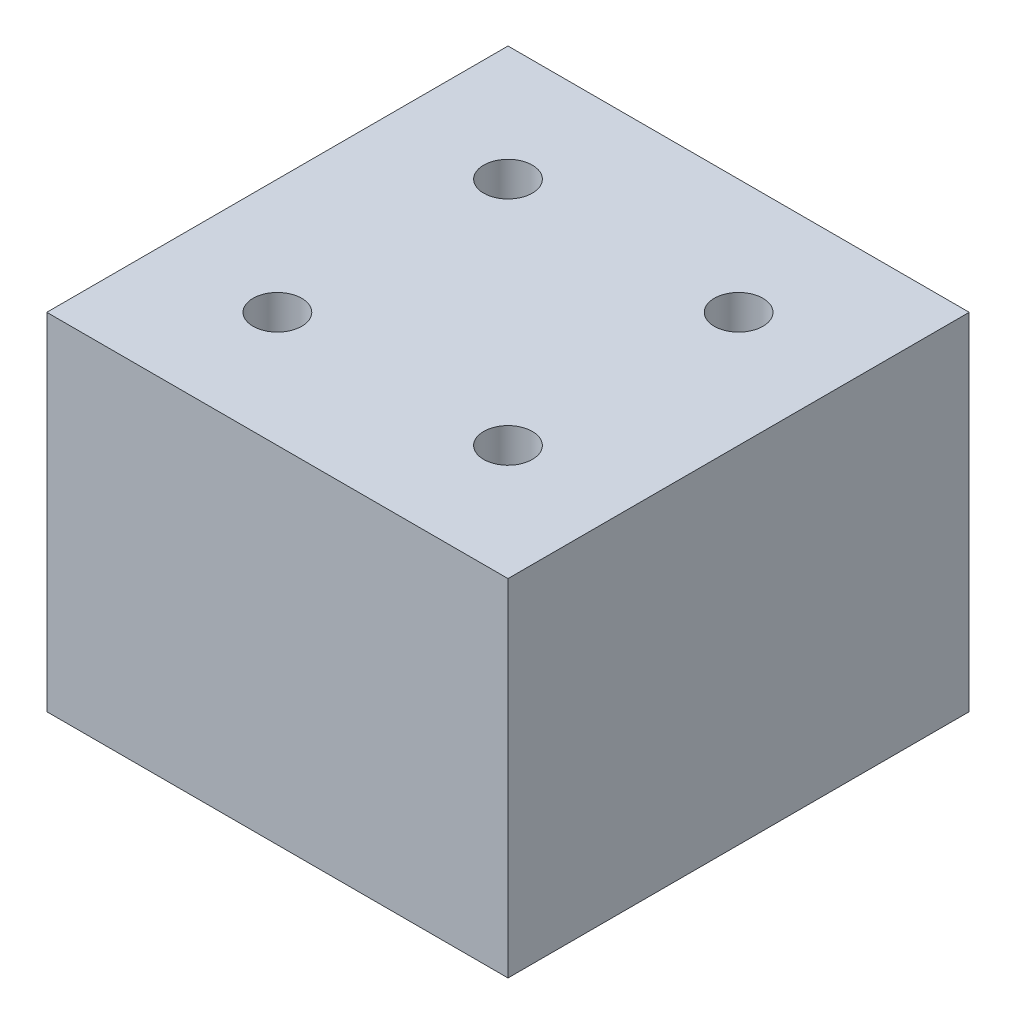
ISO-10303-21;
HEADER;
FILE_DESCRIPTION(('STEP AP214'),'2;1');
FILE_NAME('part.step','',(''),(''),'','','');
FILE_SCHEMA(('AUTOMOTIVE_DESIGN { 1 0 10303 214 1 1 1 1 }'));
ENDSEC;
DATA;
#1=APPLICATION_CONTEXT('core data for automotive mechanical design processes');
#2=APPLICATION_PROTOCOL_DEFINITION('international standard','automotive_design',2000,#1);
#3=PRODUCT_CONTEXT('',#1,'mechanical');
#4=PRODUCT('Part','Part','',(#3));
#5=PRODUCT_RELATED_PRODUCT_CATEGORY('part','',(#4));
#6=PRODUCT_DEFINITION_FORMATION('','',#4);
#7=PRODUCT_DEFINITION_CONTEXT('part definition',#1,'design');
#8=PRODUCT_DEFINITION('design','',#6,#7);
#9=PRODUCT_DEFINITION_SHAPE('','',#8);
#10=(LENGTH_UNIT() NAMED_UNIT(*) SI_UNIT(.MILLI.,.METRE.));
#11=(NAMED_UNIT(*) PLANE_ANGLE_UNIT() SI_UNIT($,.RADIAN.));
#12=(NAMED_UNIT(*) SI_UNIT($,.STERADIAN.) SOLID_ANGLE_UNIT());
#13=UNCERTAINTY_MEASURE_WITH_UNIT(LENGTH_MEASURE(1.E-05),#10,'distance_accuracy_value','');
#14=(GEOMETRIC_REPRESENTATION_CONTEXT(3) GLOBAL_UNCERTAINTY_ASSIGNED_CONTEXT((#13)) GLOBAL_UNIT_ASSIGNED_CONTEXT((#10,
#11,#12)) REPRESENTATION_CONTEXT('',''));
#15=CARTESIAN_POINT('',(0.,0.,0.));
#16=DIRECTION('',(0.,0.,1.));
#17=DIRECTION('',(1.,0.,0.));
#18=AXIS2_PLACEMENT_3D('',#15,#16,#17);
#19=CARTESIAN_POINT('',(0.,76.2,0.));
#20=DIRECTION('',(1.,0.,0.));
#21=DIRECTION('',(0.,0.,-1.));
#22=AXIS2_PLACEMENT_3D('',#19,#20,#21);
#23=PLANE('',#22);
#24=DIRECTION('',(0.,0.,1.));
#25=VECTOR('',#24,1.);
#26=CARTESIAN_POINT('',(0.,0.,0.));
#27=LINE('',#26,#25);
#28=CARTESIAN_POINT('',(0.,0.,-101.6));
#29=VERTEX_POINT('',#28);
#30=CARTESIAN_POINT('',(0.,0.,0.));
#31=VERTEX_POINT('',#30);
#32=EDGE_CURVE('E147',#29,#31,#27,.T.);
#33=ORIENTED_EDGE('',*,*,#32,.T.);
#34=DIRECTION('',(0.,-1.,0.));
#35=VECTOR('',#34,1.);
#36=CARTESIAN_POINT('',(0.,76.2,0.));
#37=LINE('',#36,#35);
#38=CARTESIAN_POINT('',(0.,76.2,0.));
#39=VERTEX_POINT('',#38);
#40=EDGE_CURVE('E11',#39,#31,#37,.T.);
#41=ORIENTED_EDGE('',*,*,#40,.F.);
#42=DIRECTION('',(0.,0.,1.));
#43=VECTOR('',#42,1.);
#44=CARTESIAN_POINT('',(0.,76.2,0.));
#45=LINE('',#44,#43);
#46=CARTESIAN_POINT('',(0.,76.2,-101.6));
#47=VERTEX_POINT('',#46);
#48=EDGE_CURVE('E148',#47,#39,#45,.T.);
#49=ORIENTED_EDGE('',*,*,#48,.F.);
#50=DIRECTION('',(0.,-1.,0.));
#51=VECTOR('',#50,1.);
#52=CARTESIAN_POINT('',(0.,76.2,-101.6));
#53=LINE('',#52,#51);
#54=EDGE_CURVE('E158',#47,#29,#53,.T.);
#55=ORIENTED_EDGE('',*,*,#54,.T.);
#56=EDGE_LOOP('',(#33,#41,#49,#55));
#57=FACE_BOUND('',#56,.T.);
#58=ADVANCED_FACE('F45',(#57),#23,.F.);
#59=CARTESIAN_POINT('',(0.,76.2,0.));
#60=DIRECTION('',(0.,0.,-1.));
#61=DIRECTION('',(-1.,0.,0.));
#62=AXIS2_PLACEMENT_3D('',#59,#60,#61);
#63=PLANE('',#62);
#64=DIRECTION('',(1.,0.,0.));
#65=VECTOR('',#64,1.);
#66=CARTESIAN_POINT('',(0.,0.,0.));
#67=LINE('',#66,#65);
#68=CARTESIAN_POINT('',(101.6,0.,0.));
#69=VERTEX_POINT('',#68);
#70=EDGE_CURVE('E162',#31,#69,#67,.T.);
#71=ORIENTED_EDGE('',*,*,#70,.T.);
#72=DIRECTION('',(0.,-1.,0.));
#73=VECTOR('',#72,1.);
#74=CARTESIAN_POINT('',(101.6,76.2,0.));
#75=LINE('',#74,#73);
#76=CARTESIAN_POINT('',(101.6,76.2,0.));
#77=VERTEX_POINT('',#76);
#78=EDGE_CURVE('E54',#77,#69,#75,.T.);
#79=ORIENTED_EDGE('',*,*,#78,.F.);
#80=DIRECTION('',(1.,0.,0.));
#81=VECTOR('',#80,1.);
#82=CARTESIAN_POINT('',(0.,76.2,0.));
#83=LINE('',#82,#81);
#84=EDGE_CURVE('E93',#39,#77,#83,.T.);
#85=ORIENTED_EDGE('',*,*,#84,.F.);
#86=ORIENTED_EDGE('',*,*,#40,.T.);
#87=EDGE_LOOP('',(#71,#79,#85,#86));
#88=FACE_BOUND('',#87,.T.);
#89=ADVANCED_FACE('F192',(#88),#63,.F.);
#90=CARTESIAN_POINT('',(101.6,76.2,0.));
#91=DIRECTION('',(-1.,0.,0.));
#92=DIRECTION('',(0.,0.,1.));
#93=AXIS2_PLACEMENT_3D('',#90,#91,#92);
#94=PLANE('',#93);
#95=DIRECTION('',(0.,0.,-1.));
#96=VECTOR('',#95,1.);
#97=CARTESIAN_POINT('',(101.6,0.,0.));
#98=LINE('',#97,#96);
#99=CARTESIAN_POINT('',(101.6,0.,-101.6));
#100=VERTEX_POINT('',#99);
#101=EDGE_CURVE('E80',#69,#100,#98,.T.);
#102=ORIENTED_EDGE('',*,*,#101,.T.);
#103=DIRECTION('',(0.,-1.,0.));
#104=VECTOR('',#103,1.);
#105=CARTESIAN_POINT('',(101.6,76.2,-101.6));
#106=LINE('',#105,#104);
#107=CARTESIAN_POINT('',(101.6,76.2,-101.6));
#108=VERTEX_POINT('',#107);
#109=EDGE_CURVE('E171',#108,#100,#106,.T.);
#110=ORIENTED_EDGE('',*,*,#109,.F.);
#111=DIRECTION('',(0.,0.,-1.));
#112=VECTOR('',#111,1.);
#113=CARTESIAN_POINT('',(101.6,76.2,0.));
#114=LINE('',#113,#112);
#115=EDGE_CURVE('E153',#77,#108,#114,.T.);
#116=ORIENTED_EDGE('',*,*,#115,.F.);
#117=ORIENTED_EDGE('',*,*,#78,.T.);
#118=EDGE_LOOP('',(#102,#110,#116,#117));
#119=FACE_BOUND('',#118,.T.);
#120=ADVANCED_FACE('F175',(#119),#94,.F.);
#121=CARTESIAN_POINT('',(0.,76.2,-101.6));
#122=DIRECTION('',(0.,0.,1.));
#123=DIRECTION('',(1.,0.,0.));
#124=AXIS2_PLACEMENT_3D('',#121,#122,#123);
#125=PLANE('',#124);
#126=DIRECTION('',(-1.,0.,0.));
#127=VECTOR('',#126,1.);
#128=CARTESIAN_POINT('',(0.,0.,-101.6));
#129=LINE('',#128,#127);
#130=EDGE_CURVE('E86',#100,#29,#129,.T.);
#131=ORIENTED_EDGE('',*,*,#130,.T.);
#132=ORIENTED_EDGE('',*,*,#54,.F.);
#133=DIRECTION('',(-1.,0.,0.));
#134=VECTOR('',#133,1.);
#135=CARTESIAN_POINT('',(0.,76.2,-101.6));
#136=LINE('',#135,#134);
#137=EDGE_CURVE('E62',#108,#47,#136,.T.);
#138=ORIENTED_EDGE('',*,*,#137,.F.);
#139=ORIENTED_EDGE('',*,*,#109,.T.);
#140=EDGE_LOOP('',(#131,#132,#138,#139));
#141=FACE_BOUND('',#140,.T.);
#142=ADVANCED_FACE('F182',(#141),#125,.F.);
#143=CARTESIAN_POINT('',(0.,76.2,0.));
#144=DIRECTION('',(0.,-1.,0.));
#145=DIRECTION('',(0.,0.,-1.));
#146=AXIS2_PLACEMENT_3D('',#143,#144,#145);
#147=PLANE('',#146);
#148=CARTESIAN_POINT('',(25.4,76.2,-25.4));
#149=DIRECTION('',(0.,1.,0.));
#150=DIRECTION('',(0.,0.,1.));
#151=AXIS2_PLACEMENT_3D('',#148,#149,#150);
#152=CIRCLE('',#151,5.35812999999999);
#153=CARTESIAN_POINT('',(25.4,76.2,-20.04187));
#154=VERTEX_POINT('',#153);
#155=EDGE_CURVE('E118',#154,#154,#152,.T.);
#156=ORIENTED_EDGE('',*,*,#155,.F.);
#157=EDGE_LOOP('',(#156));
#158=FACE_BOUND('',#157,.T.);
#159=CARTESIAN_POINT('',(25.4,76.2,-76.2));
#160=DIRECTION('',(0.,1.,0.));
#161=DIRECTION('',(0.,0.,1.));
#162=AXIS2_PLACEMENT_3D('',#159,#160,#161);
#163=CIRCLE('',#162,5.35812999999999);
#164=CARTESIAN_POINT('',(25.4,76.2,-70.84187));
#165=VERTEX_POINT('',#164);
#166=EDGE_CURVE('E117',#165,#165,#163,.T.);
#167=ORIENTED_EDGE('',*,*,#166,.F.);
#168=EDGE_LOOP('',(#167));
#169=FACE_BOUND('',#168,.T.);
#170=CARTESIAN_POINT('',(76.2,76.2,-76.2));
#171=DIRECTION('',(0.,1.,0.));
#172=DIRECTION('',(0.,0.,1.));
#173=AXIS2_PLACEMENT_3D('',#170,#171,#172);
#174=CIRCLE('',#173,5.35812999999999);
#175=CARTESIAN_POINT('',(76.2,76.2,-70.84187));
#176=VERTEX_POINT('',#175);
#177=EDGE_CURVE('E131',#176,#176,#174,.T.);
#178=ORIENTED_EDGE('',*,*,#177,.F.);
#179=EDGE_LOOP('',(#178));
#180=FACE_BOUND('',#179,.T.);
#181=CARTESIAN_POINT('',(76.2,76.2,-25.4));
#182=DIRECTION('',(0.,1.,0.));
#183=DIRECTION('',(0.,0.,1.));
#184=AXIS2_PLACEMENT_3D('',#181,#182,#183);
#185=CIRCLE('',#184,5.35812999999999);
#186=CARTESIAN_POINT('',(76.2,76.2,-20.04187));
#187=VERTEX_POINT('',#186);
#188=EDGE_CURVE('E139',#187,#187,#185,.T.);
#189=ORIENTED_EDGE('',*,*,#188,.F.);
#190=EDGE_LOOP('',(#189));
#191=FACE_BOUND('',#190,.T.);
#192=ORIENTED_EDGE('',*,*,#48,.T.);
#193=ORIENTED_EDGE('',*,*,#84,.T.);
#194=ORIENTED_EDGE('',*,*,#115,.T.);
#195=ORIENTED_EDGE('',*,*,#137,.T.);
#196=EDGE_LOOP('',(#192,#193,#194,#195));
#197=FACE_BOUND('',#196,.T.);
#198=ADVANCED_FACE('F184',(#158,#169,#180,#191,#197),#147,.F.);
#199=CARTESIAN_POINT('',(0.,0.,0.));
#200=DIRECTION('',(0.,-1.,0.));
#201=DIRECTION('',(0.,0.,-1.));
#202=AXIS2_PLACEMENT_3D('',#199,#200,#201);
#203=PLANE('',#202);
#204=ORIENTED_EDGE('',*,*,#32,.F.);
#205=ORIENTED_EDGE('',*,*,#130,.F.);
#206=ORIENTED_EDGE('',*,*,#101,.F.);
#207=ORIENTED_EDGE('',*,*,#70,.F.);
#208=EDGE_LOOP('',(#204,#205,#206,#207));
#209=FACE_BOUND('',#208,.T.);
#210=ADVANCED_FACE('F178',(#209),#203,.T.);
#211=CARTESIAN_POINT('',(76.2,41.148,-25.4));
#212=DIRECTION('',(0.,1.,0.));
#213=DIRECTION('',(0.,0.,1.));
#214=AXIS2_PLACEMENT_3D('',#211,#212,#213);
#215=CONICAL_SURFACE('',#214,5.35812999999999,1.02974425867665);
#216=CARTESIAN_POINT('',(76.2,37.9285106913699,-25.4));
#217=VERTEX_POINT('',#216);
#218=VERTEX_LOOP('',#217);
#219=FACE_BOUND('',#218,.T.);
#220=CARTESIAN_POINT('',(76.2,41.148,-25.4));
#221=DIRECTION('',(0.,1.,0.));
#222=DIRECTION('',(0.,0.,1.));
#223=AXIS2_PLACEMENT_3D('',#220,#221,#222);
#224=CIRCLE('',#223,5.35812999999999);
#225=CARTESIAN_POINT('',(76.2,41.148,-20.04187));
#226=VERTEX_POINT('',#225);
#227=EDGE_CURVE('E143',#226,#226,#224,.T.);
#228=ORIENTED_EDGE('',*,*,#227,.T.);
#229=EDGE_LOOP('',(#228));
#230=FACE_BOUND('',#229,.T.);
#231=ADVANCED_FACE('F219',(#219,#230),#215,.F.);
#232=CARTESIAN_POINT('',(76.2,76.2,-25.4));
#233=DIRECTION('',(0.,1.,0.));
#234=DIRECTION('',(0.,0.,1.));
#235=AXIS2_PLACEMENT_3D('',#232,#233,#234);
#236=CYLINDRICAL_SURFACE('',#235,5.35812999999999);
#237=ORIENTED_EDGE('',*,*,#227,.F.);
#238=EDGE_LOOP('',(#237));
#239=FACE_BOUND('',#238,.T.);
#240=ORIENTED_EDGE('',*,*,#188,.T.);
#241=EDGE_LOOP('',(#240));
#242=FACE_BOUND('',#241,.T.);
#243=ADVANCED_FACE('F237',(#239,#242),#236,.F.);
#244=CARTESIAN_POINT('',(76.2,41.148,-76.2));
#245=DIRECTION('',(0.,1.,0.));
#246=DIRECTION('',(0.,0.,1.));
#247=AXIS2_PLACEMENT_3D('',#244,#245,#246);
#248=CONICAL_SURFACE('',#247,5.35812999999999,1.02974425867665);
#249=CARTESIAN_POINT('',(76.2,37.9285106913699,-76.2));
#250=VERTEX_POINT('',#249);
#251=VERTEX_LOOP('',#250);
#252=FACE_BOUND('',#251,.T.);
#253=CARTESIAN_POINT('',(76.2,41.148,-76.2));
#254=DIRECTION('',(0.,1.,0.));
#255=DIRECTION('',(0.,0.,1.));
#256=AXIS2_PLACEMENT_3D('',#253,#254,#255);
#257=CIRCLE('',#256,5.35812999999999);
#258=CARTESIAN_POINT('',(76.2,41.148,-70.84187));
#259=VERTEX_POINT('',#258);
#260=EDGE_CURVE('E135',#259,#259,#257,.T.);
#261=ORIENTED_EDGE('',*,*,#260,.T.);
#262=EDGE_LOOP('',(#261));
#263=FACE_BOUND('',#262,.T.);
#264=ADVANCED_FACE('F248',(#252,#263),#248,.F.);
#265=CARTESIAN_POINT('',(76.2,76.2,-76.2));
#266=DIRECTION('',(0.,1.,0.));
#267=DIRECTION('',(0.,0.,1.));
#268=AXIS2_PLACEMENT_3D('',#265,#266,#267);
#269=CYLINDRICAL_SURFACE('',#268,5.35812999999999);
#270=ORIENTED_EDGE('',*,*,#260,.F.);
#271=EDGE_LOOP('',(#270));
#272=FACE_BOUND('',#271,.T.);
#273=ORIENTED_EDGE('',*,*,#177,.T.);
#274=EDGE_LOOP('',(#273));
#275=FACE_BOUND('',#274,.T.);
#276=ADVANCED_FACE('F259',(#272,#275),#269,.F.);
#277=CARTESIAN_POINT('',(25.4,41.148,-76.2));
#278=DIRECTION('',(0.,1.,0.));
#279=DIRECTION('',(0.,0.,1.));
#280=AXIS2_PLACEMENT_3D('',#277,#278,#279);
#281=CONICAL_SURFACE('',#280,5.35812999999999,1.02974425867665);
#282=CARTESIAN_POINT('',(25.4,37.9285106913699,-76.2));
#283=VERTEX_POINT('',#282);
#284=VERTEX_LOOP('',#283);
#285=FACE_BOUND('',#284,.T.);
#286=CARTESIAN_POINT('',(25.4,41.148,-76.2));
#287=DIRECTION('',(0.,1.,0.));
#288=DIRECTION('',(0.,0.,1.));
#289=AXIS2_PLACEMENT_3D('',#286,#287,#288);
#290=CIRCLE('',#289,5.35812999999999);
#291=CARTESIAN_POINT('',(25.4,41.148,-70.84187));
#292=VERTEX_POINT('',#291);
#293=EDGE_CURVE('E123',#292,#292,#290,.T.);
#294=ORIENTED_EDGE('',*,*,#293,.T.);
#295=EDGE_LOOP('',(#294));
#296=FACE_BOUND('',#295,.T.);
#297=ADVANCED_FACE('F269',(#285,#296),#281,.F.);
#298=CARTESIAN_POINT('',(25.4,76.2,-76.2));
#299=DIRECTION('',(0.,1.,0.));
#300=DIRECTION('',(0.,0.,1.));
#301=AXIS2_PLACEMENT_3D('',#298,#299,#300);
#302=CYLINDRICAL_SURFACE('',#301,5.35812999999999);
#303=ORIENTED_EDGE('',*,*,#293,.F.);
#304=EDGE_LOOP('',(#303));
#305=FACE_BOUND('',#304,.T.);
#306=ORIENTED_EDGE('',*,*,#166,.T.);
#307=EDGE_LOOP('',(#306));
#308=FACE_BOUND('',#307,.T.);
#309=ADVANCED_FACE('F110',(#305,#308),#302,.F.);
#310=CARTESIAN_POINT('',(25.4,41.148,-25.4));
#311=DIRECTION('',(0.,1.,0.));
#312=DIRECTION('',(0.,0.,1.));
#313=AXIS2_PLACEMENT_3D('',#310,#311,#312);
#314=CONICAL_SURFACE('',#313,5.35812999999999,1.02974425867665);
#315=CARTESIAN_POINT('',(25.4,37.9285106913699,-25.4));
#316=VERTEX_POINT('',#315);
#317=VERTEX_LOOP('',#316);
#318=FACE_BOUND('',#317,.T.);
#319=CARTESIAN_POINT('',(25.4,41.148,-25.4));
#320=DIRECTION('',(0.,1.,0.));
#321=DIRECTION('',(0.,0.,1.));
#322=AXIS2_PLACEMENT_3D('',#319,#320,#321);
#323=CIRCLE('',#322,5.35812999999999);
#324=CARTESIAN_POINT('',(25.4,41.148,-20.04187));
#325=VERTEX_POINT('',#324);
#326=EDGE_CURVE('E114',#325,#325,#323,.T.);
#327=ORIENTED_EDGE('',*,*,#326,.T.);
#328=EDGE_LOOP('',(#327));
#329=FACE_BOUND('',#328,.T.);
#330=ADVANCED_FACE('F106',(#318,#329),#314,.F.);
#331=CARTESIAN_POINT('',(25.4,76.2,-25.4));
#332=DIRECTION('',(0.,1.,0.));
#333=DIRECTION('',(0.,0.,1.));
#334=AXIS2_PLACEMENT_3D('',#331,#332,#333);
#335=CYLINDRICAL_SURFACE('',#334,5.35812999999999);
#336=ORIENTED_EDGE('',*,*,#326,.F.);
#337=EDGE_LOOP('',(#336));
#338=FACE_BOUND('',#337,.T.);
#339=ORIENTED_EDGE('',*,*,#155,.T.);
#340=EDGE_LOOP('',(#339));
#341=FACE_BOUND('',#340,.T.);
#342=ADVANCED_FACE('F109',(#338,#341),#335,.F.);
#343=CLOSED_SHELL('',(#58,#89,#120,#142,#198,#210,#231,#243,#264,#276,#297,#309,#330,#342));
#344=MANIFOLD_SOLID_BREP('B2',#343);
#345=ADVANCED_BREP_SHAPE_REPRESENTATION('',(#18,#344),#14);
#346=SHAPE_DEFINITION_REPRESENTATION(#9,#345);
ENDSEC;
END-ISO-10303-21;
